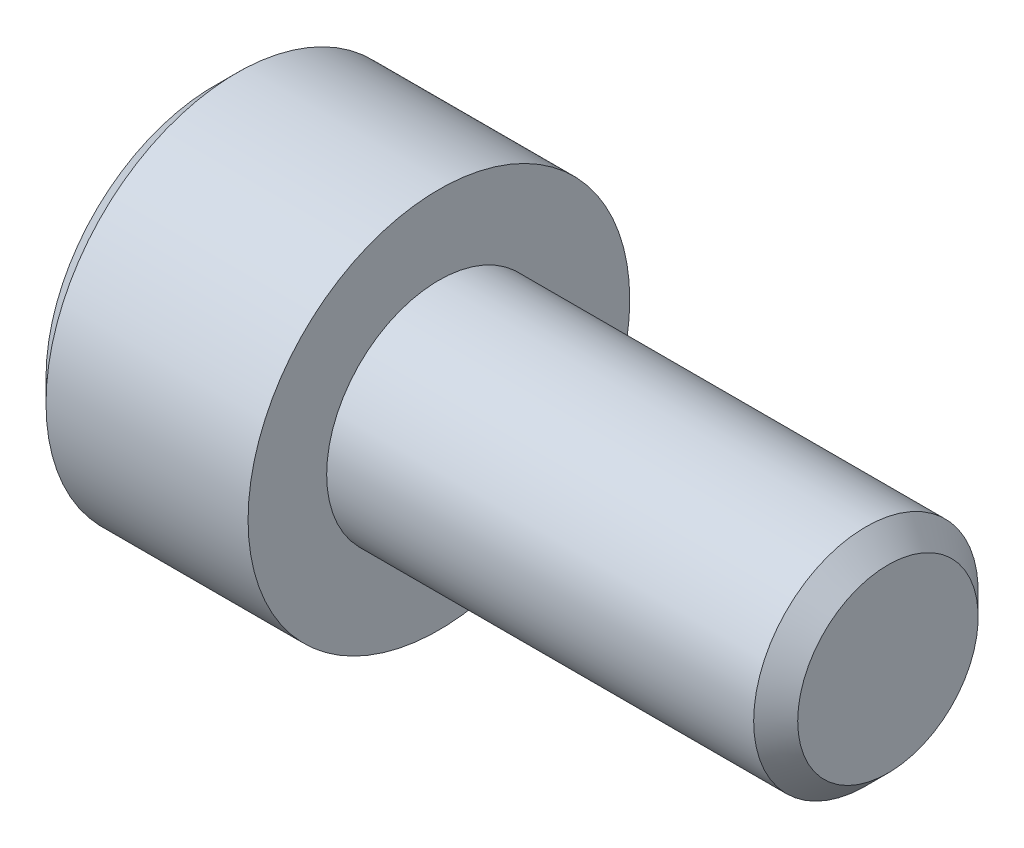
ISO-10303-21;
HEADER;
FILE_DESCRIPTION(('STEP AP214'),'2;1');
FILE_NAME('part.step','',(''),(''),'','','');
FILE_SCHEMA(('AUTOMOTIVE_DESIGN { 1 0 10303 214 1 1 1 1 }'));
ENDSEC;
DATA;
#1=APPLICATION_CONTEXT('core data for automotive mechanical design processes');
#2=APPLICATION_PROTOCOL_DEFINITION('international standard','automotive_design',2000,#1);
#3=PRODUCT_CONTEXT('',#1,'mechanical');
#4=PRODUCT('Part','Part','',(#3));
#5=PRODUCT_RELATED_PRODUCT_CATEGORY('part','',(#4));
#6=PRODUCT_DEFINITION_FORMATION('','',#4);
#7=PRODUCT_DEFINITION_CONTEXT('part definition',#1,'design');
#8=PRODUCT_DEFINITION('design','',#6,#7);
#9=PRODUCT_DEFINITION_SHAPE('','',#8);
#10=(LENGTH_UNIT() NAMED_UNIT(*) SI_UNIT(.MILLI.,.METRE.));
#11=(NAMED_UNIT(*) PLANE_ANGLE_UNIT() SI_UNIT($,.RADIAN.));
#12=(NAMED_UNIT(*) SI_UNIT($,.STERADIAN.) SOLID_ANGLE_UNIT());
#13=UNCERTAINTY_MEASURE_WITH_UNIT(LENGTH_MEASURE(1.E-05),#10,'distance_accuracy_value','');
#14=(GEOMETRIC_REPRESENTATION_CONTEXT(3) GLOBAL_UNCERTAINTY_ASSIGNED_CONTEXT((#13)) GLOBAL_UNIT_ASSIGNED_CONTEXT((#10,
#11,#12)) REPRESENTATION_CONTEXT('',''));
#15=CARTESIAN_POINT('',(0.,0.,0.));
#16=DIRECTION('',(0.,0.,1.));
#17=DIRECTION('',(1.,0.,0.));
#18=AXIS2_PLACEMENT_3D('',#15,#16,#17);
#19=CARTESIAN_POINT('',(-2.5,0.,0.));
#20=DIRECTION('',(1.,0.,0.));
#21=DIRECTION('',(0.,0.,-1.));
#22=AXIS2_PLACEMENT_3D('',#19,#20,#21);
#23=PLANE('',#22);
#24=DIRECTION('',(0.,1.,0.));
#25=VECTOR('',#24,1.);
#26=CARTESIAN_POINT('',(-2.5,0.,2.));
#27=LINE('',#26,#25);
#28=CARTESIAN_POINT('',(-2.5,1.15470053837925,2.));
#29=VERTEX_POINT('',#28);
#30=CARTESIAN_POINT('',(-2.49999999999988,0.,2.00000000000477));
#31=VERTEX_POINT('',#30);
#32=EDGE_CURVE('E109',#29,#31,#27,.F.);
#33=ORIENTED_EDGE('',*,*,#32,.F.);
#34=DIRECTION('',(0.,-0.500000000000003,0.866025403784437));
#35=VECTOR('',#34,1.);
#36=CARTESIAN_POINT('',(-2.5,1.73205080756888,1.));
#37=LINE('',#36,#35);
#38=CARTESIAN_POINT('',(-2.49999999999988,1.73205080757301,1.00000000000239));
#39=VERTEX_POINT('',#38);
#40=EDGE_CURVE('E93',#39,#29,#37,.T.);
#41=ORIENTED_EDGE('',*,*,#40,.F.);
#42=CARTESIAN_POINT('',(-2.49999999999977,0.,0.));
#43=DIRECTION('',(-1.,0.,0.));
#44=DIRECTION('',(0.,0.,1.));
#45=AXIS2_PLACEMENT_3D('',#42,#43,#44);
#46=CIRCLE('',#45,2.00000000000955);
#47=EDGE_CURVE('E20',#39,#31,#46,.F.);
#48=ORIENTED_EDGE('',*,*,#47,.T.);
#49=EDGE_LOOP('',(#33,#41,#48));
#50=FACE_BOUND('',#49,.T.);
#51=ADVANCED_FACE('F17',(#50),#23,.F.);
#52=CARTESIAN_POINT('',(-2.5,0.,0.));
#53=DIRECTION('',(1.,0.,0.));
#54=DIRECTION('',(0.,0.,-1.));
#55=AXIS2_PLACEMENT_3D('',#52,#53,#54);
#56=PLANE('',#55);
#57=DIRECTION('',(0.,0.499999999999996,-0.866025403784441));
#58=VECTOR('',#57,1.);
#59=CARTESIAN_POINT('',(-2.5,-2.3094010767585,0.));
#60=LINE('',#59,#58);
#61=CARTESIAN_POINT('',(-2.5,-2.3094010767585,0.));
#62=VERTEX_POINT('',#61);
#63=CARTESIAN_POINT('',(-2.49999999999988,-1.73205080757301,-1.00000000000239));
#64=VERTEX_POINT('',#63);
#65=EDGE_CURVE('E149',#62,#64,#60,.T.);
#66=ORIENTED_EDGE('',*,*,#65,.F.);
#67=DIRECTION('',(0.,-0.499999999999996,-0.866025403784441));
#68=VECTOR('',#67,1.);
#69=CARTESIAN_POINT('',(-2.5,-1.73205080756888,1.));
#70=LINE('',#69,#68);
#71=CARTESIAN_POINT('',(-2.49999999999977,-1.73205080757301,1.00000000000239));
#72=VERTEX_POINT('',#71);
#73=EDGE_CURVE('E153',#72,#62,#70,.T.);
#74=ORIENTED_EDGE('',*,*,#73,.F.);
#75=CARTESIAN_POINT('',(-2.49999999999977,0.,0.));
#76=DIRECTION('',(-1.,0.,0.));
#77=DIRECTION('',(0.,0.,1.));
#78=AXIS2_PLACEMENT_3D('',#75,#76,#77);
#79=CIRCLE('',#78,2.00000000000955);
#80=EDGE_CURVE('E123',#72,#64,#79,.F.);
#81=ORIENTED_EDGE('',*,*,#80,.T.);
#82=EDGE_LOOP('',(#66,#74,#81));
#83=FACE_BOUND('',#82,.T.);
#84=ADVANCED_FACE('F420',(#83),#56,.F.);
#85=CARTESIAN_POINT('',(-2.5,0.,0.));
#86=DIRECTION('',(1.,0.,0.));
#87=DIRECTION('',(0.,0.,-1.));
#88=AXIS2_PLACEMENT_3D('',#85,#86,#87);
#89=PLANE('',#88);
#90=DIRECTION('',(0.,1.,0.));
#91=VECTOR('',#90,1.);
#92=CARTESIAN_POINT('',(-2.5,0.,-2.));
#93=LINE('',#92,#91);
#94=CARTESIAN_POINT('',(-2.5,-1.15470053837925,-2.));
#95=VERTEX_POINT('',#94);
#96=CARTESIAN_POINT('',(-2.49999999999988,0.,-2.00000000000477));
#97=VERTEX_POINT('',#96);
#98=EDGE_CURVE('E141',#95,#97,#93,.T.);
#99=ORIENTED_EDGE('',*,*,#98,.F.);
#100=DIRECTION('',(0.,0.500000000000003,-0.866025403784437));
#101=VECTOR('',#100,1.);
#102=CARTESIAN_POINT('',(-2.5,-1.73205080756888,-1.));
#103=LINE('',#102,#101);
#104=EDGE_CURVE('E145',#64,#95,#103,.T.);
#105=ORIENTED_EDGE('',*,*,#104,.F.);
#106=CARTESIAN_POINT('',(-2.49999999999977,0.,0.));
#107=DIRECTION('',(-1.,0.,0.));
#108=DIRECTION('',(0.,0.,1.));
#109=AXIS2_PLACEMENT_3D('',#106,#107,#108);
#110=CIRCLE('',#109,2.00000000000955);
#111=EDGE_CURVE('E125',#64,#97,#110,.F.);
#112=ORIENTED_EDGE('',*,*,#111,.T.);
#113=EDGE_LOOP('',(#99,#105,#112));
#114=FACE_BOUND('',#113,.T.);
#115=ADVANCED_FACE('F207',(#114),#89,.F.);
#116=CARTESIAN_POINT('',(-2.5,0.,0.));
#117=DIRECTION('',(1.,0.,0.));
#118=DIRECTION('',(0.,0.,-1.));
#119=AXIS2_PLACEMENT_3D('',#116,#117,#118);
#120=PLANE('',#119);
#121=DIRECTION('',(0.,0.500000000000003,0.866025403784437));
#122=VECTOR('',#121,1.);
#123=CARTESIAN_POINT('',(-2.5,1.15470053837925,-2.));
#124=LINE('',#123,#122);
#125=CARTESIAN_POINT('',(-2.5,1.15470053837925,-2.));
#126=VERTEX_POINT('',#125);
#127=CARTESIAN_POINT('',(-2.49999999999988,1.73205080757301,-1.00000000000239));
#128=VERTEX_POINT('',#127);
#129=EDGE_CURVE('E101',#126,#128,#124,.T.);
#130=ORIENTED_EDGE('',*,*,#129,.F.);
#131=DIRECTION('',(0.,1.,0.));
#132=VECTOR('',#131,1.);
#133=CARTESIAN_POINT('',(-2.5,0.,-2.));
#134=LINE('',#133,#132);
#135=EDGE_CURVE('E137',#97,#126,#134,.T.);
#136=ORIENTED_EDGE('',*,*,#135,.F.);
#137=CARTESIAN_POINT('',(-2.49999999999977,0.,0.));
#138=DIRECTION('',(-1.,0.,0.));
#139=DIRECTION('',(0.,0.,1.));
#140=AXIS2_PLACEMENT_3D('',#137,#138,#139);
#141=CIRCLE('',#140,2.00000000000955);
#142=EDGE_CURVE('E117',#97,#128,#141,.F.);
#143=ORIENTED_EDGE('',*,*,#142,.T.);
#144=EDGE_LOOP('',(#130,#136,#143));
#145=FACE_BOUND('',#144,.T.);
#146=ADVANCED_FACE('F210',(#145),#120,.F.);
#147=CARTESIAN_POINT('',(-2.5,0.,0.));
#148=DIRECTION('',(1.,0.,0.));
#149=DIRECTION('',(0.,0.,-1.));
#150=AXIS2_PLACEMENT_3D('',#147,#148,#149);
#151=PLANE('',#150);
#152=CARTESIAN_POINT('',(-2.49999999999977,0.,0.));
#153=DIRECTION('',(-1.,0.,0.));
#154=DIRECTION('',(0.,0.,1.));
#155=AXIS2_PLACEMENT_3D('',#152,#153,#154);
#156=CIRCLE('',#155,2.00000000000955);
#157=EDGE_CURVE('E112',#128,#39,#156,.F.);
#158=ORIENTED_EDGE('',*,*,#157,.T.);
#159=DIRECTION('',(0.,-0.499999999999996,0.866025403784441));
#160=VECTOR('',#159,1.);
#161=CARTESIAN_POINT('',(-2.5,2.3094010767585,0.));
#162=LINE('',#161,#160);
#163=CARTESIAN_POINT('',(-2.5,2.3094010767585,0.));
#164=VERTEX_POINT('',#163);
#165=EDGE_CURVE('E89',#164,#39,#162,.T.);
#166=ORIENTED_EDGE('',*,*,#165,.F.);
#167=DIRECTION('',(0.,0.499999999999996,0.866025403784441));
#168=VECTOR('',#167,1.);
#169=CARTESIAN_POINT('',(-2.5,1.73205080756888,-1.));
#170=LINE('',#169,#168);
#171=EDGE_CURVE('E100',#128,#164,#170,.T.);
#172=ORIENTED_EDGE('',*,*,#171,.F.);
#173=EDGE_LOOP('',(#158,#166,#172));
#174=FACE_BOUND('',#173,.T.);
#175=ADVANCED_FACE('F113',(#174),#151,.F.);
#176=CARTESIAN_POINT('',(-2.4999999999693,0.,0.));
#177=DIRECTION('',(-1.,0.,0.));
#178=DIRECTION('',(0.,0.,1.));
#179=AXIS2_PLACEMENT_3D('',#176,#177,#178);
#180=CONICAL_SURFACE('',#179,1.99999999989586,1.30899693895162);
#181=CARTESIAN_POINT('',(-1.96410161512972,0.,-1.13686837721616E-10));
#182=VERTEX_POINT('',#181);
#183=VERTEX_LOOP('',#182);
#184=FACE_BOUND('',#183,.T.);
#185=ORIENTED_EDGE('',*,*,#142,.F.);
#186=ORIENTED_EDGE('',*,*,#111,.F.);
#187=ORIENTED_EDGE('',*,*,#80,.F.);
#188=CARTESIAN_POINT('',(-2.49999999999977,0.,0.));
#189=DIRECTION('',(-1.,0.,0.));
#190=DIRECTION('',(0.,0.,1.));
#191=AXIS2_PLACEMENT_3D('',#188,#189,#190);
#192=CIRCLE('',#191,2.00000000000955);
#193=EDGE_CURVE('E116',#72,#31,#192,.T.);
#194=ORIENTED_EDGE('',*,*,#193,.T.);
#195=ORIENTED_EDGE('',*,*,#47,.F.);
#196=ORIENTED_EDGE('',*,*,#157,.F.);
#197=EDGE_LOOP('',(#185,#186,#187,#194,#195,#196));
#198=FACE_BOUND('',#197,.T.);
#199=ADVANCED_FACE('F119',(#184,#198),#180,.F.);
#200=CARTESIAN_POINT('',(-2.5,0.,0.));
#201=DIRECTION('',(1.,0.,0.));
#202=DIRECTION('',(0.,0.,-1.));
#203=AXIS2_PLACEMENT_3D('',#200,#201,#202);
#204=PLANE('',#203);
#205=DIRECTION('',(0.,0.5,0.866025403784439));
#206=VECTOR('',#205,1.);
#207=CARTESIAN_POINT('',(-2.5,-1.15470053837925,2.));
#208=LINE('',#207,#206);
#209=CARTESIAN_POINT('',(-2.5,-1.15470053837925,2.));
#210=VERTEX_POINT('',#209);
#211=EDGE_CURVE('E197',#210,#72,#208,.F.);
#212=ORIENTED_EDGE('',*,*,#211,.F.);
#213=DIRECTION('',(0.,1.,0.));
#214=VECTOR('',#213,1.);
#215=CARTESIAN_POINT('',(-2.5,1.15470053837925,2.));
#216=LINE('',#215,#214);
#217=EDGE_CURVE('E227',#31,#210,#216,.F.);
#218=ORIENTED_EDGE('',*,*,#217,.F.);
#219=ORIENTED_EDGE('',*,*,#193,.F.);
#220=EDGE_LOOP('',(#212,#218,#219));
#221=FACE_BOUND('',#220,.T.);
#222=ADVANCED_FACE('F240',(#221),#204,.F.);
#223=CARTESIAN_POINT('',(-2.5,-1.15470053837925,2.));
#224=DIRECTION('',(0.,0.866025403784439,-0.5));
#225=DIRECTION('',(0.,0.5,0.866025403784439));
#226=AXIS2_PLACEMENT_3D('',#223,#224,#225);
#227=PLANE('',#226);
#228=ORIENTED_EDGE('',*,*,#73,.T.);
#229=DIRECTION('',(1.,0.,0.));
#230=VECTOR('',#229,1.);
#231=CARTESIAN_POINT('',(-2.5,-2.3094010767585,0.));
#232=LINE('',#231,#230);
#233=CARTESIAN_POINT('',(-5.,-2.3094010767585,0.));
#234=VERTEX_POINT('',#233);
#235=EDGE_CURVE('E170',#234,#62,#232,.T.);
#236=ORIENTED_EDGE('',*,*,#235,.F.);
#237=DIRECTION('',(0.,0.499999999999999,0.866025403784439));
#238=VECTOR('',#237,1.);
#239=CARTESIAN_POINT('',(-5.,-2.3094010767585,0.));
#240=LINE('',#239,#238);
#241=CARTESIAN_POINT('',(-5.,-1.15470053837925,2.));
#242=VERTEX_POINT('',#241);
#243=EDGE_CURVE('E175',#234,#242,#240,.T.);
#244=ORIENTED_EDGE('',*,*,#243,.T.);
#245=DIRECTION('',(-1.,0.,0.));
#246=VECTOR('',#245,1.);
#247=CARTESIAN_POINT('',(-2.5,-1.15470053837925,2.));
#248=LINE('',#247,#246);
#249=EDGE_CURVE('E183',#210,#242,#248,.T.);
#250=ORIENTED_EDGE('',*,*,#249,.F.);
#251=ORIENTED_EDGE('',*,*,#211,.T.);
#252=EDGE_LOOP('',(#228,#236,#244,#250,#251));
#253=FACE_BOUND('',#252,.T.);
#254=ADVANCED_FACE('F238',(#253),#227,.T.);
#255=CARTESIAN_POINT('',(-2.5,1.15470053837925,2.));
#256=DIRECTION('',(0.,0.,-1.));
#257=DIRECTION('',(-1.,0.,0.));
#258=AXIS2_PLACEMENT_3D('',#255,#256,#257);
#259=PLANE('',#258);
#260=ORIENTED_EDGE('',*,*,#217,.T.);
#261=ORIENTED_EDGE('',*,*,#249,.T.);
#262=DIRECTION('',(0.,1.,0.));
#263=VECTOR('',#262,1.);
#264=CARTESIAN_POINT('',(-5.,0.,2.));
#265=LINE('',#264,#263);
#266=CARTESIAN_POINT('',(-5.,1.15470053837925,2.));
#267=VERTEX_POINT('',#266);
#268=EDGE_CURVE('E221',#242,#267,#265,.T.);
#269=ORIENTED_EDGE('',*,*,#268,.T.);
#270=DIRECTION('',(1.,0.,0.));
#271=VECTOR('',#270,1.);
#272=CARTESIAN_POINT('',(-2.5,1.15470053837925,2.));
#273=LINE('',#272,#271);
#274=EDGE_CURVE('E166',#29,#267,#273,.F.);
#275=ORIENTED_EDGE('',*,*,#274,.F.);
#276=ORIENTED_EDGE('',*,*,#32,.T.);
#277=EDGE_LOOP('',(#260,#261,#269,#275,#276));
#278=FACE_BOUND('',#277,.T.);
#279=ADVANCED_FACE('F242',(#278),#259,.T.);
#280=CARTESIAN_POINT('',(-2.5,2.3094010767585,0.));
#281=DIRECTION('',(0.,-0.866025403784439,-0.5));
#282=DIRECTION('',(0.,0.5,-0.866025403784439));
#283=AXIS2_PLACEMENT_3D('',#280,#281,#282);
#284=PLANE('',#283);
#285=ORIENTED_EDGE('',*,*,#40,.T.);
#286=ORIENTED_EDGE('',*,*,#274,.T.);
#287=DIRECTION('',(0.,0.499999999999999,-0.866025403784439));
#288=VECTOR('',#287,1.);
#289=CARTESIAN_POINT('',(-5.,1.15470053837925,2.));
#290=LINE('',#289,#288);
#291=CARTESIAN_POINT('',(-5.,2.3094010767585,0.));
#292=VERTEX_POINT('',#291);
#293=EDGE_CURVE('E218',#267,#292,#290,.T.);
#294=ORIENTED_EDGE('',*,*,#293,.T.);
#295=DIRECTION('',(1.,0.,0.));
#296=VECTOR('',#295,1.);
#297=CARTESIAN_POINT('',(-2.5,2.3094010767585,0.));
#298=LINE('',#297,#296);
#299=EDGE_CURVE('E96',#164,#292,#298,.F.);
#300=ORIENTED_EDGE('',*,*,#299,.F.);
#301=ORIENTED_EDGE('',*,*,#165,.T.);
#302=EDGE_LOOP('',(#285,#286,#294,#300,#301));
#303=FACE_BOUND('',#302,.T.);
#304=ADVANCED_FACE('F91',(#303),#284,.T.);
#305=CARTESIAN_POINT('',(-2.5,1.15470053837925,-2.));
#306=DIRECTION('',(0.,-0.866025403784439,0.5));
#307=DIRECTION('',(0.,-0.5,-0.866025403784439));
#308=AXIS2_PLACEMENT_3D('',#305,#306,#307);
#309=PLANE('',#308);
#310=ORIENTED_EDGE('',*,*,#171,.T.);
#311=ORIENTED_EDGE('',*,*,#299,.T.);
#312=DIRECTION('',(0.,-0.499999999999999,-0.866025403784439));
#313=VECTOR('',#312,1.);
#314=CARTESIAN_POINT('',(-5.,2.3094010767585,0.));
#315=LINE('',#314,#313);
#316=CARTESIAN_POINT('',(-5.,1.15470053837925,-2.));
#317=VERTEX_POINT('',#316);
#318=EDGE_CURVE('E215',#292,#317,#315,.T.);
#319=ORIENTED_EDGE('',*,*,#318,.T.);
#320=DIRECTION('',(1.,0.,0.));
#321=VECTOR('',#320,1.);
#322=CARTESIAN_POINT('',(-2.5,1.15470053837925,-2.));
#323=LINE('',#322,#321);
#324=EDGE_CURVE('E165',#126,#317,#323,.F.);
#325=ORIENTED_EDGE('',*,*,#324,.F.);
#326=ORIENTED_EDGE('',*,*,#129,.T.);
#327=EDGE_LOOP('',(#310,#311,#319,#325,#326));
#328=FACE_BOUND('',#327,.T.);
#329=ADVANCED_FACE('F213',(#328),#309,.T.);
#330=CARTESIAN_POINT('',(-2.5,-1.15470053837925,-2.));
#331=DIRECTION('',(0.,0.,1.));
#332=DIRECTION('',(1.,0.,0.));
#333=AXIS2_PLACEMENT_3D('',#330,#331,#332);
#334=PLANE('',#333);
#335=ORIENTED_EDGE('',*,*,#135,.T.);
#336=ORIENTED_EDGE('',*,*,#324,.T.);
#337=DIRECTION('',(0.,1.,0.));
#338=VECTOR('',#337,1.);
#339=CARTESIAN_POINT('',(-5.,0.,-2.));
#340=LINE('',#339,#338);
#341=CARTESIAN_POINT('',(-5.,-1.15470053837925,-2.));
#342=VERTEX_POINT('',#341);
#343=EDGE_CURVE('E35',#317,#342,#340,.F.);
#344=ORIENTED_EDGE('',*,*,#343,.T.);
#345=DIRECTION('',(1.,0.,0.));
#346=VECTOR('',#345,1.);
#347=CARTESIAN_POINT('',(-2.5,-1.15470053837925,-2.));
#348=LINE('',#347,#346);
#349=EDGE_CURVE('E173',#95,#342,#348,.F.);
#350=ORIENTED_EDGE('',*,*,#349,.F.);
#351=ORIENTED_EDGE('',*,*,#98,.T.);
#352=EDGE_LOOP('',(#335,#336,#344,#350,#351));
#353=FACE_BOUND('',#352,.T.);
#354=ADVANCED_FACE('F212',(#353),#334,.T.);
#355=CARTESIAN_POINT('',(-2.5,-2.3094010767585,0.));
#356=DIRECTION('',(0.,0.866025403784439,0.5));
#357=DIRECTION('',(0.,-0.5,0.866025403784439));
#358=AXIS2_PLACEMENT_3D('',#355,#356,#357);
#359=PLANE('',#358);
#360=ORIENTED_EDGE('',*,*,#104,.T.);
#361=ORIENTED_EDGE('',*,*,#349,.T.);
#362=DIRECTION('',(0.,-0.499999999999999,0.866025403784439));
#363=VECTOR('',#362,1.);
#364=CARTESIAN_POINT('',(-5.,-1.15470053837925,-2.));
#365=LINE('',#364,#363);
#366=EDGE_CURVE('E196',#342,#234,#365,.T.);
#367=ORIENTED_EDGE('',*,*,#366,.T.);
#368=ORIENTED_EDGE('',*,*,#235,.T.);
#369=ORIENTED_EDGE('',*,*,#65,.T.);
#370=EDGE_LOOP('',(#360,#361,#367,#368,#369));
#371=FACE_BOUND('',#370,.T.);
#372=ADVANCED_FACE('F251',(#371),#359,.T.);
#373=CARTESIAN_POINT('',(-5.,0.,0.));
#374=DIRECTION('',(1.,0.,0.));
#375=DIRECTION('',(0.,0.,-1.));
#376=AXIS2_PLACEMENT_3D('',#373,#374,#375);
#377=PLANE('',#376);
#378=ORIENTED_EDGE('',*,*,#343,.F.);
#379=ORIENTED_EDGE('',*,*,#318,.F.);
#380=ORIENTED_EDGE('',*,*,#293,.F.);
#381=ORIENTED_EDGE('',*,*,#268,.F.);
#382=ORIENTED_EDGE('',*,*,#243,.F.);
#383=ORIENTED_EDGE('',*,*,#366,.F.);
#384=EDGE_LOOP('',(#378,#379,#380,#381,#382,#383));
#385=FACE_BOUND('',#384,.T.);
#386=CARTESIAN_POINT('',(-4.99999999999545,0.,0.));
#387=DIRECTION('',(1.,0.,0.));
#388=DIRECTION('',(0.,0.,-1.));
#389=AXIS2_PLACEMENT_3D('',#386,#387,#388);
#390=CIRCLE('',#389,3.74999999996817);
#391=CARTESIAN_POINT('',(-4.99999999999545,0.,-3.74999999996817));
#392=VERTEX_POINT('',#391);
#393=EDGE_CURVE('E193',#392,#392,#390,.T.);
#394=ORIENTED_EDGE('',*,*,#393,.F.);
#395=EDGE_LOOP('',(#394));
#396=FACE_BOUND('',#395,.T.);
#397=ADVANCED_FACE('F244',(#385,#396),#377,.F.);
#398=CARTESIAN_POINT('',(-4.50000000000728,0.,0.));
#399=DIRECTION('',(1.,0.,0.));
#400=DIRECTION('',(0.,0.,-1.));
#401=AXIS2_PLACEMENT_3D('',#398,#399,#400);
#402=CONICAL_SURFACE('',#401,4.25000000001319,0.785398163454292);
#403=ORIENTED_EDGE('',*,*,#393,.T.);
#404=EDGE_LOOP('',(#403));
#405=FACE_BOUND('',#404,.T.);
#406=CARTESIAN_POINT('',(-4.5,0.,0.));
#407=DIRECTION('',(-1.,0.,0.));
#408=DIRECTION('',(0.,0.,1.));
#409=AXIS2_PLACEMENT_3D('',#406,#407,#408);
#410=CIRCLE('',#409,4.25);
#411=CARTESIAN_POINT('',(-4.5,0.,4.25));
#412=VERTEX_POINT('',#411);
#413=EDGE_CURVE('E192',#412,#412,#410,.F.);
#414=ORIENTED_EDGE('',*,*,#413,.F.);
#415=EDGE_LOOP('',(#414));
#416=FACE_BOUND('',#415,.T.);
#417=ADVANCED_FACE('F274',(#405,#416),#402,.T.);
#418=CARTESIAN_POINT('',(10.,2.0095,0.));
#419=DIRECTION('',(-1.,0.,0.));
#420=DIRECTION('',(0.,0.,1.));
#421=AXIS2_PLACEMENT_3D('',#418,#419,#420);
#422=PLANE('',#421);
#423=CARTESIAN_POINT('',(9.99999999999091,0.,0.));
#424=DIRECTION('',(-1.,0.,0.));
#425=DIRECTION('',(0.,0.,1.));
#426=AXIS2_PLACEMENT_3D('',#423,#424,#425);
#427=CIRCLE('',#426,2.00949999998556);
#428=CARTESIAN_POINT('',(9.99999999999091,0.,2.00949999998556));
#429=VERTEX_POINT('',#428);
#430=EDGE_CURVE('E189',#429,#429,#427,.T.);
#431=ORIENTED_EDGE('',*,*,#430,.F.);
#432=EDGE_LOOP('',(#431));
#433=FACE_BOUND('',#432,.T.);
#434=ADVANCED_FACE('F272',(#433),#422,.F.);
#435=CARTESIAN_POINT('',(10.,0.,0.));
#436=DIRECTION('',(-1.,0.,0.));
#437=DIRECTION('',(0.,0.,1.));
#438=AXIS2_PLACEMENT_3D('',#435,#436,#437);
#439=CYLINDRICAL_SURFACE('',#438,4.25);
#440=ORIENTED_EDGE('',*,*,#413,.T.);
#441=EDGE_LOOP('',(#440));
#442=FACE_BOUND('',#441,.T.);
#443=CARTESIAN_POINT('',(0.,0.,0.));
#444=DIRECTION('',(-1.,0.,0.));
#445=DIRECTION('',(0.,0.,1.));
#446=AXIS2_PLACEMENT_3D('',#443,#444,#445);
#447=CIRCLE('',#446,4.25);
#448=CARTESIAN_POINT('',(0.,0.,4.25));
#449=VERTEX_POINT('',#448);
#450=EDGE_CURVE('E186',#449,#449,#447,.T.);
#451=ORIENTED_EDGE('',*,*,#450,.T.);
#452=EDGE_LOOP('',(#451));
#453=FACE_BOUND('',#452,.T.);
#454=ADVANCED_FACE('F268',(#442,#453),#439,.T.);
#455=CARTESIAN_POINT('',(9.50950000009243,0.,0.));
#456=DIRECTION('',(-1.,0.,0.));
#457=DIRECTION('',(0.,0.,1.));
#458=AXIS2_PLACEMENT_3D('',#455,#456,#457);
#459=CONICAL_SURFACE('',#458,2.49999999988404,0.785398163397448);
#460=CARTESIAN_POINT('',(9.5095,0.,0.));
#461=DIRECTION('',(-1.,0.,0.));
#462=DIRECTION('',(0.,0.,1.));
#463=AXIS2_PLACEMENT_3D('',#460,#461,#462);
#464=CIRCLE('',#463,2.5);
#465=CARTESIAN_POINT('',(9.5095,0.,2.5));
#466=VERTEX_POINT('',#465);
#467=EDGE_CURVE('E26',#466,#466,#464,.T.);
#468=ORIENTED_EDGE('',*,*,#467,.F.);
#469=EDGE_LOOP('',(#468));
#470=FACE_BOUND('',#469,.T.);
#471=ORIENTED_EDGE('',*,*,#430,.T.);
#472=EDGE_LOOP('',(#471));
#473=FACE_BOUND('',#472,.T.);
#474=ADVANCED_FACE('F264',(#470,#473),#459,.T.);
#475=CARTESIAN_POINT('',(0.,4.25,0.));
#476=DIRECTION('',(-1.,0.,0.));
#477=DIRECTION('',(0.,0.,1.));
#478=AXIS2_PLACEMENT_3D('',#475,#476,#477);
#479=PLANE('',#478);
#480=ORIENTED_EDGE('',*,*,#450,.F.);
#481=EDGE_LOOP('',(#480));
#482=FACE_BOUND('',#481,.T.);
#483=CARTESIAN_POINT('',(0.,0.,0.));
#484=DIRECTION('',(-1.,0.,0.));
#485=DIRECTION('',(0.,0.,1.));
#486=AXIS2_PLACEMENT_3D('',#483,#484,#485);
#487=CIRCLE('',#486,2.5);
#488=CARTESIAN_POINT('',(0.,0.,2.5));
#489=VERTEX_POINT('',#488);
#490=EDGE_CURVE('E11',#489,#489,#487,.F.);
#491=ORIENTED_EDGE('',*,*,#490,.F.);
#492=EDGE_LOOP('',(#491));
#493=FACE_BOUND('',#492,.T.);
#494=ADVANCED_FACE('F267',(#482,#493),#479,.F.);
#495=CARTESIAN_POINT('',(10.,0.,0.));
#496=DIRECTION('',(-1.,0.,0.));
#497=DIRECTION('',(0.,0.,1.));
#498=AXIS2_PLACEMENT_3D('',#495,#496,#497);
#499=CYLINDRICAL_SURFACE('',#498,2.5);
#500=ORIENTED_EDGE('',*,*,#490,.T.);
#501=EDGE_LOOP('',(#500));
#502=FACE_BOUND('',#501,.T.);
#503=ORIENTED_EDGE('',*,*,#467,.T.);
#504=EDGE_LOOP('',(#503));
#505=FACE_BOUND('',#504,.T.);
#506=ADVANCED_FACE('F262',(#502,#505),#499,.T.);
#507=CLOSED_SHELL('',(#51,#84,#115,#146,#175,#199,#222,#254,#279,#304,#329,#354,#372,#397,#417,
#434,#454,#474,#494,#506));
#508=MANIFOLD_SOLID_BREP('B1',#507);
#509=ADVANCED_BREP_SHAPE_REPRESENTATION('',(#18,#508),#14);
#510=SHAPE_DEFINITION_REPRESENTATION(#9,#509);
ENDSEC;
END-ISO-10303-21;
